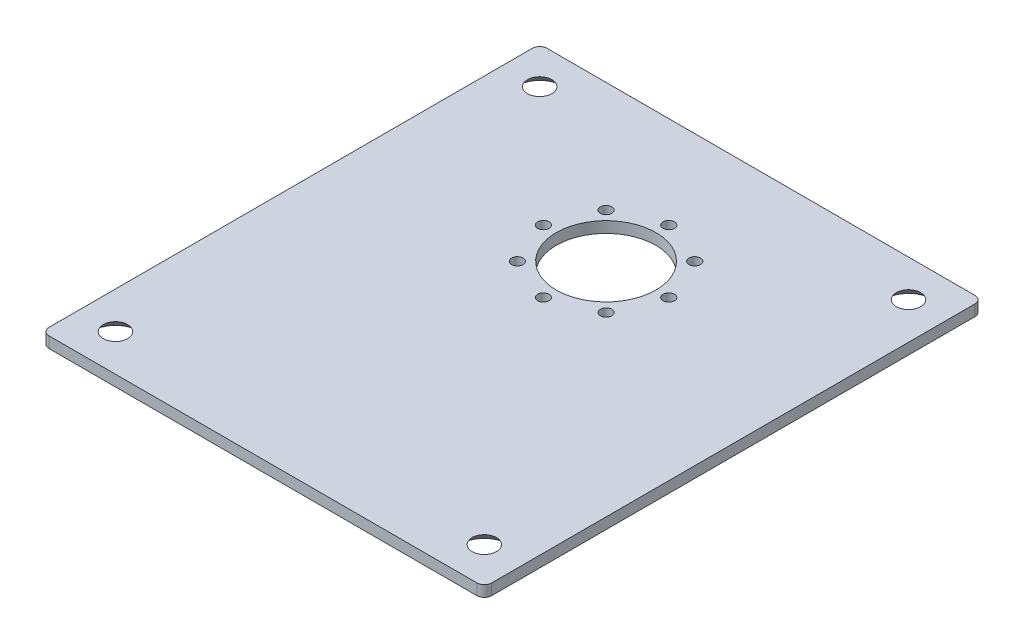
ISO-10303-21;
HEADER;
FILE_DESCRIPTION(('STEP AP214'),'2;1');
FILE_NAME('part.step','',(''),(''),'','','');
FILE_SCHEMA(('AUTOMOTIVE_DESIGN { 1 0 10303 214 1 1 1 1 }'));
ENDSEC;
DATA;
#1=APPLICATION_CONTEXT('core data for automotive mechanical design processes');
#2=APPLICATION_PROTOCOL_DEFINITION('international standard','automotive_design',2000,#1);
#3=PRODUCT_CONTEXT('',#1,'mechanical');
#4=PRODUCT('Part','Part','',(#3));
#5=PRODUCT_RELATED_PRODUCT_CATEGORY('part','',(#4));
#6=PRODUCT_DEFINITION_FORMATION('','',#4);
#7=PRODUCT_DEFINITION_CONTEXT('part definition',#1,'design');
#8=PRODUCT_DEFINITION('design','',#6,#7);
#9=PRODUCT_DEFINITION_SHAPE('','',#8);
#10=(LENGTH_UNIT() NAMED_UNIT(*) SI_UNIT(.MILLI.,.METRE.));
#11=(NAMED_UNIT(*) PLANE_ANGLE_UNIT() SI_UNIT($,.RADIAN.));
#12=(NAMED_UNIT(*) SI_UNIT($,.STERADIAN.) SOLID_ANGLE_UNIT());
#13=UNCERTAINTY_MEASURE_WITH_UNIT(LENGTH_MEASURE(1.E-05),#10,'distance_accuracy_value','');
#14=(GEOMETRIC_REPRESENTATION_CONTEXT(3) GLOBAL_UNCERTAINTY_ASSIGNED_CONTEXT((#13)) GLOBAL_UNIT_ASSIGNED_CONTEXT((#10,
#11,#12)) REPRESENTATION_CONTEXT('',''));
#15=CARTESIAN_POINT('',(0.,0.,0.));
#16=DIRECTION('',(0.,0.,1.));
#17=DIRECTION('',(1.,0.,0.));
#18=AXIS2_PLACEMENT_3D('',#15,#16,#17);
#19=CARTESIAN_POINT('',(0.,3.,0.));
#20=DIRECTION('',(0.,-1.,0.));
#21=DIRECTION('',(0.,0.,-1.));
#22=AXIS2_PLACEMENT_3D('',#19,#20,#21);
#23=PLANE('',#22);
#24=CARTESIAN_POINT('',(-50.,3.,57.5));
#25=DIRECTION('',(0.,-1.,0.));
#26=DIRECTION('',(0.,0.,-1.));
#27=AXIS2_PLACEMENT_3D('',#24,#25,#26);
#28=CIRCLE('',#27,3.3);
#29=CARTESIAN_POINT('',(-50.,3.,54.2));
#30=VERTEX_POINT('',#29);
#31=EDGE_CURVE('E403',#30,#30,#28,.T.);
#32=ORIENTED_EDGE('',*,*,#31,.T.);
#33=EDGE_LOOP('',(#32));
#34=FACE_BOUND('',#33,.T.);
#35=CARTESIAN_POINT('',(50.,3.,57.5));
#36=DIRECTION('',(0.,-1.,0.));
#37=DIRECTION('',(0.,0.,-1.));
#38=AXIS2_PLACEMENT_3D('',#35,#36,#37);
#39=CIRCLE('',#38,3.3);
#40=CARTESIAN_POINT('',(50.,3.,54.2));
#41=VERTEX_POINT('',#40);
#42=EDGE_CURVE('E408',#41,#41,#39,.T.);
#43=ORIENTED_EDGE('',*,*,#42,.T.);
#44=EDGE_LOOP('',(#43));
#45=FACE_BOUND('',#44,.T.);
#46=CARTESIAN_POINT('',(50.,3.,-57.5));
#47=DIRECTION('',(0.,-1.,0.));
#48=DIRECTION('',(0.,0.,-1.));
#49=AXIS2_PLACEMENT_3D('',#46,#47,#48);
#50=CIRCLE('',#49,3.3);
#51=CARTESIAN_POINT('',(50.,3.,-60.8));
#52=VERTEX_POINT('',#51);
#53=EDGE_CURVE('E412',#52,#52,#50,.T.);
#54=ORIENTED_EDGE('',*,*,#53,.T.);
#55=EDGE_LOOP('',(#54));
#56=FACE_BOUND('',#55,.T.);
#57=CARTESIAN_POINT('',(-50.,3.,-57.5));
#58=DIRECTION('',(0.,-1.,0.));
#59=DIRECTION('',(0.,0.,-1.));
#60=AXIS2_PLACEMENT_3D('',#57,#58,#59);
#61=CIRCLE('',#60,3.3);
#62=CARTESIAN_POINT('',(-50.,3.,-60.8));
#63=VERTEX_POINT('',#62);
#64=EDGE_CURVE('E417',#63,#63,#61,.T.);
#65=ORIENTED_EDGE('',*,*,#64,.T.);
#66=EDGE_LOOP('',(#65));
#67=FACE_BOUND('',#66,.T.);
#68=CARTESIAN_POINT('',(17.,3.,-25.5));
#69=DIRECTION('',(0.,-1.,0.));
#70=DIRECTION('',(-1.,0.,0.));
#71=AXIS2_PLACEMENT_3D('',#68,#69,#70);
#72=CIRCLE('',#71,1.55);
#73=CARTESIAN_POINT('',(15.45,3.,-25.5));
#74=VERTEX_POINT('',#73);
#75=EDGE_CURVE('E12',#74,#74,#72,.T.);
#76=ORIENTED_EDGE('',*,*,#75,.T.);
#77=EDGE_LOOP('',(#76));
#78=FACE_BOUND('',#77,.T.);
#79=CARTESIAN_POINT('',(12.0208152801713,3.,-37.5208152801713));
#80=DIRECTION('',(0.,-1.,0.));
#81=DIRECTION('',(-1.,0.,0.));
#82=AXIS2_PLACEMENT_3D('',#79,#80,#81);
#83=CIRCLE('',#82,1.55);
#84=CARTESIAN_POINT('',(10.4708152801713,3.,-37.5208152801713));
#85=VERTEX_POINT('',#84);
#86=EDGE_CURVE('E54',#85,#85,#83,.T.);
#87=ORIENTED_EDGE('',*,*,#86,.T.);
#88=EDGE_LOOP('',(#87));
#89=FACE_BOUND('',#88,.T.);
#90=CARTESIAN_POINT('',(-12.0208152801713,3.,-37.5208152801713));
#91=DIRECTION('',(0.,-1.,0.));
#92=DIRECTION('',(-1.,0.,0.));
#93=AXIS2_PLACEMENT_3D('',#90,#91,#92);
#94=CIRCLE('',#93,1.55);
#95=CARTESIAN_POINT('',(-13.5708152801713,3.,-37.5208152801713));
#96=VERTEX_POINT('',#95);
#97=EDGE_CURVE('E214',#96,#96,#94,.T.);
#98=ORIENTED_EDGE('',*,*,#97,.T.);
#99=EDGE_LOOP('',(#98));
#100=FACE_BOUND('',#99,.T.);
#101=CARTESIAN_POINT('',(0.,3.,-42.5));
#102=DIRECTION('',(0.,-1.,0.));
#103=DIRECTION('',(-1.,0.,0.));
#104=AXIS2_PLACEMENT_3D('',#101,#102,#103);
#105=CIRCLE('',#104,1.55);
#106=CARTESIAN_POINT('',(-1.55,3.,-42.5));
#107=VERTEX_POINT('',#106);
#108=EDGE_CURVE('E151',#107,#107,#105,.T.);
#109=ORIENTED_EDGE('',*,*,#108,.T.);
#110=EDGE_LOOP('',(#109));
#111=FACE_BOUND('',#110,.T.);
#112=DIRECTION('',(-1.,0.,0.));
#113=VECTOR('',#112,1.);
#114=CARTESIAN_POINT('',(60.,3.,67.5));
#115=LINE('',#114,#113);
#116=CARTESIAN_POINT('',(58.,3.,67.5));
#117=VERTEX_POINT('',#116);
#118=CARTESIAN_POINT('',(-58.,3.,67.5));
#119=VERTEX_POINT('',#118);
#120=EDGE_CURVE('E139',#117,#119,#115,.T.);
#121=ORIENTED_EDGE('',*,*,#120,.F.);
#122=CARTESIAN_POINT('',(58.,3.,65.5));
#123=DIRECTION('',(0.,1.,0.));
#124=DIRECTION('',(0.,0.,-1.));
#125=AXIS2_PLACEMENT_3D('',#122,#123,#124);
#126=CIRCLE('',#125,2.);
#127=CARTESIAN_POINT('',(60.,3.,65.5));
#128=VERTEX_POINT('',#127);
#129=EDGE_CURVE('E148',#117,#128,#126,.T.);
#130=ORIENTED_EDGE('',*,*,#129,.T.);
#131=DIRECTION('',(0.,0.,1.));
#132=VECTOR('',#131,1.);
#133=CARTESIAN_POINT('',(60.,3.,-67.5));
#134=LINE('',#133,#132);
#135=CARTESIAN_POINT('',(60.,3.,-65.5));
#136=VERTEX_POINT('',#135);
#137=EDGE_CURVE('E219',#136,#128,#134,.T.);
#138=ORIENTED_EDGE('',*,*,#137,.F.);
#139=CARTESIAN_POINT('',(58.,3.,-65.5));
#140=DIRECTION('',(0.,1.,0.));
#141=DIRECTION('',(0.,0.,-1.));
#142=AXIS2_PLACEMENT_3D('',#139,#140,#141);
#143=CIRCLE('',#142,2.);
#144=CARTESIAN_POINT('',(58.,3.,-67.5));
#145=VERTEX_POINT('',#144);
#146=EDGE_CURVE('E152',#136,#145,#143,.T.);
#147=ORIENTED_EDGE('',*,*,#146,.T.);
#148=DIRECTION('',(1.,0.,0.));
#149=VECTOR('',#148,1.);
#150=CARTESIAN_POINT('',(-60.,3.,-67.5));
#151=LINE('',#150,#149);
#152=CARTESIAN_POINT('',(-58.,3.,-67.5));
#153=VERTEX_POINT('',#152);
#154=EDGE_CURVE('E162',#153,#145,#151,.T.);
#155=ORIENTED_EDGE('',*,*,#154,.F.);
#156=CARTESIAN_POINT('',(-58.,3.,-65.5));
#157=DIRECTION('',(0.,1.,0.));
#158=DIRECTION('',(0.,0.,-1.));
#159=AXIS2_PLACEMENT_3D('',#156,#157,#158);
#160=CIRCLE('',#159,2.);
#161=CARTESIAN_POINT('',(-60.,3.,-65.5));
#162=VERTEX_POINT('',#161);
#163=EDGE_CURVE('E155',#153,#162,#160,.T.);
#164=ORIENTED_EDGE('',*,*,#163,.T.);
#165=DIRECTION('',(0.,0.,-1.));
#166=VECTOR('',#165,1.);
#167=CARTESIAN_POINT('',(-60.,3.,67.5));
#168=LINE('',#167,#166);
#169=CARTESIAN_POINT('',(-60.,3.,65.5));
#170=VERTEX_POINT('',#169);
#171=EDGE_CURVE('E204',#170,#162,#168,.T.);
#172=ORIENTED_EDGE('',*,*,#171,.F.);
#173=CARTESIAN_POINT('',(-58.,3.,65.5));
#174=DIRECTION('',(0.,1.,0.));
#175=DIRECTION('',(0.,0.,-1.));
#176=AXIS2_PLACEMENT_3D('',#173,#174,#175);
#177=CIRCLE('',#176,2.);
#178=EDGE_CURVE('E182',#170,#119,#177,.T.);
#179=ORIENTED_EDGE('',*,*,#178,.T.);
#180=EDGE_LOOP('',(#121,#130,#138,#147,#155,#164,#172,#179));
#181=FACE_BOUND('',#180,.T.);
#182=CARTESIAN_POINT('',(0.,3.,-8.5));
#183=DIRECTION('',(0.,-1.,0.));
#184=DIRECTION('',(-1.,0.,0.));
#185=AXIS2_PLACEMENT_3D('',#182,#183,#184);
#186=CIRCLE('',#185,1.55);
#187=CARTESIAN_POINT('',(-1.55,3.,-8.5));
#188=VERTEX_POINT('',#187);
#189=EDGE_CURVE('E179',#188,#188,#186,.T.);
#190=ORIENTED_EDGE('',*,*,#189,.T.);
#191=EDGE_LOOP('',(#190));
#192=FACE_BOUND('',#191,.T.);
#193=CARTESIAN_POINT('',(-12.0208152801713,3.,-13.4791847198287));
#194=DIRECTION('',(0.,-1.,0.));
#195=DIRECTION('',(-1.,0.,0.));
#196=AXIS2_PLACEMENT_3D('',#193,#194,#195);
#197=CIRCLE('',#196,1.55);
#198=CARTESIAN_POINT('',(-13.5708152801713,3.,-13.4791847198287));
#199=VERTEX_POINT('',#198);
#200=EDGE_CURVE('E176',#199,#199,#197,.T.);
#201=ORIENTED_EDGE('',*,*,#200,.T.);
#202=EDGE_LOOP('',(#201));
#203=FACE_BOUND('',#202,.T.);
#204=CARTESIAN_POINT('',(12.0208152801713,3.,-13.4791847198287));
#205=DIRECTION('',(0.,-1.,0.));
#206=DIRECTION('',(-1.,0.,0.));
#207=AXIS2_PLACEMENT_3D('',#204,#205,#206);
#208=CIRCLE('',#207,1.55);
#209=CARTESIAN_POINT('',(10.4708152801713,3.,-13.4791847198287));
#210=VERTEX_POINT('',#209);
#211=EDGE_CURVE('E138',#210,#210,#208,.T.);
#212=ORIENTED_EDGE('',*,*,#211,.T.);
#213=EDGE_LOOP('',(#212));
#214=FACE_BOUND('',#213,.T.);
#215=CARTESIAN_POINT('',(0.,3.,-25.5));
#216=DIRECTION('',(0.,-1.,0.));
#217=DIRECTION('',(-1.,0.,0.));
#218=AXIS2_PLACEMENT_3D('',#215,#216,#217);
#219=CIRCLE('',#218,13.5);
#220=CARTESIAN_POINT('',(-13.5,3.,-25.5));
#221=VERTEX_POINT('',#220);
#222=EDGE_CURVE('E135',#221,#221,#219,.T.);
#223=ORIENTED_EDGE('',*,*,#222,.T.);
#224=EDGE_LOOP('',(#223));
#225=FACE_BOUND('',#224,.T.);
#226=CARTESIAN_POINT('',(-17.,3.,-25.5));
#227=DIRECTION('',(0.,-1.,0.));
#228=DIRECTION('',(-1.,0.,0.));
#229=AXIS2_PLACEMENT_3D('',#226,#227,#228);
#230=CIRCLE('',#229,1.55);
#231=CARTESIAN_POINT('',(-18.55,3.,-25.5));
#232=VERTEX_POINT('',#231);
#233=EDGE_CURVE('E126',#232,#232,#230,.T.);
#234=ORIENTED_EDGE('',*,*,#233,.T.);
#235=EDGE_LOOP('',(#234));
#236=FACE_BOUND('',#235,.T.);
#237=ADVANCED_FACE('F44',(#34,#45,#56,#67,#78,#89,#100,#111,#181,#192,#203,#214,#225,#236),#23,.F.);
#238=CARTESIAN_POINT('',(0.,0.,0.));
#239=DIRECTION('',(0.,-1.,0.));
#240=DIRECTION('',(0.,0.,-1.));
#241=AXIS2_PLACEMENT_3D('',#238,#239,#240);
#242=PLANE('',#241);
#243=CARTESIAN_POINT('',(-50.,0.,57.5));
#244=DIRECTION('',(0.,-1.,0.));
#245=DIRECTION('',(0.,0.,-1.));
#246=AXIS2_PLACEMENT_3D('',#243,#244,#245);
#247=CIRCLE('',#246,6.3);
#248=CARTESIAN_POINT('',(-50.,0.,51.2));
#249=VERTEX_POINT('',#248);
#250=EDGE_CURVE('E312',#249,#249,#247,.T.);
#251=ORIENTED_EDGE('',*,*,#250,.F.);
#252=EDGE_LOOP('',(#251));
#253=FACE_BOUND('',#252,.T.);
#254=CARTESIAN_POINT('',(50.,0.,57.5));
#255=DIRECTION('',(0.,-1.,0.));
#256=DIRECTION('',(0.,0.,-1.));
#257=AXIS2_PLACEMENT_3D('',#254,#255,#256);
#258=CIRCLE('',#257,6.3);
#259=CARTESIAN_POINT('',(50.,0.,51.2));
#260=VERTEX_POINT('',#259);
#261=EDGE_CURVE('E316',#260,#260,#258,.T.);
#262=ORIENTED_EDGE('',*,*,#261,.F.);
#263=EDGE_LOOP('',(#262));
#264=FACE_BOUND('',#263,.T.);
#265=CARTESIAN_POINT('',(50.,0.,-57.5));
#266=DIRECTION('',(0.,-1.,0.));
#267=DIRECTION('',(0.,0.,-1.));
#268=AXIS2_PLACEMENT_3D('',#265,#266,#267);
#269=CIRCLE('',#268,6.3);
#270=CARTESIAN_POINT('',(50.,0.,-63.8));
#271=VERTEX_POINT('',#270);
#272=EDGE_CURVE('E320',#271,#271,#269,.T.);
#273=ORIENTED_EDGE('',*,*,#272,.F.);
#274=EDGE_LOOP('',(#273));
#275=FACE_BOUND('',#274,.T.);
#276=CARTESIAN_POINT('',(-50.,0.,-57.5));
#277=DIRECTION('',(0.,-1.,0.));
#278=DIRECTION('',(0.,0.,-1.));
#279=AXIS2_PLACEMENT_3D('',#276,#277,#278);
#280=CIRCLE('',#279,6.3);
#281=CARTESIAN_POINT('',(-50.,0.,-63.8));
#282=VERTEX_POINT('',#281);
#283=EDGE_CURVE('E324',#282,#282,#280,.T.);
#284=ORIENTED_EDGE('',*,*,#283,.F.);
#285=EDGE_LOOP('',(#284));
#286=FACE_BOUND('',#285,.T.);
#287=CARTESIAN_POINT('',(17.,0.,-25.5));
#288=DIRECTION('',(0.,1.,0.));
#289=DIRECTION('',(0.,0.,-1.));
#290=AXIS2_PLACEMENT_3D('',#287,#288,#289);
#291=CIRCLE('',#290,1.55);
#292=CARTESIAN_POINT('',(17.,0.,-27.05));
#293=VERTEX_POINT('',#292);
#294=EDGE_CURVE('E122',#293,#293,#291,.T.);
#295=ORIENTED_EDGE('',*,*,#294,.T.);
#296=EDGE_LOOP('',(#295));
#297=FACE_BOUND('',#296,.T.);
#298=CARTESIAN_POINT('',(12.0208152801713,0.,-37.5208152801713));
#299=DIRECTION('',(0.,1.,0.));
#300=DIRECTION('',(0.,0.,-1.));
#301=AXIS2_PLACEMENT_3D('',#298,#299,#300);
#302=CIRCLE('',#301,1.55);
#303=CARTESIAN_POINT('',(12.0208152801713,0.,-39.0708152801713));
#304=VERTEX_POINT('',#303);
#305=EDGE_CURVE('E118',#304,#304,#302,.T.);
#306=ORIENTED_EDGE('',*,*,#305,.T.);
#307=EDGE_LOOP('',(#306));
#308=FACE_BOUND('',#307,.T.);
#309=CARTESIAN_POINT('',(-12.0208152801713,0.,-37.5208152801713));
#310=DIRECTION('',(0.,1.,0.));
#311=DIRECTION('',(0.,0.,-1.));
#312=AXIS2_PLACEMENT_3D('',#309,#310,#311);
#313=CIRCLE('',#312,1.55);
#314=CARTESIAN_POINT('',(-12.0208152801713,0.,-39.0708152801713));
#315=VERTEX_POINT('',#314);
#316=EDGE_CURVE('E123',#315,#315,#313,.T.);
#317=ORIENTED_EDGE('',*,*,#316,.T.);
#318=EDGE_LOOP('',(#317));
#319=FACE_BOUND('',#318,.T.);
#320=CARTESIAN_POINT('',(0.,0.,-42.5));
#321=DIRECTION('',(0.,1.,0.));
#322=DIRECTION('',(0.,0.,-1.));
#323=AXIS2_PLACEMENT_3D('',#320,#321,#322);
#324=CIRCLE('',#323,1.55);
#325=CARTESIAN_POINT('',(0.,0.,-44.05));
#326=VERTEX_POINT('',#325);
#327=EDGE_CURVE('E129',#326,#326,#324,.T.);
#328=ORIENTED_EDGE('',*,*,#327,.T.);
#329=EDGE_LOOP('',(#328));
#330=FACE_BOUND('',#329,.T.);
#331=DIRECTION('',(0.,0.,1.));
#332=VECTOR('',#331,1.);
#333=CARTESIAN_POINT('',(60.,0.,-67.5));
#334=LINE('',#333,#332);
#335=CARTESIAN_POINT('',(60.,0.,-65.5));
#336=VERTEX_POINT('',#335);
#337=CARTESIAN_POINT('',(60.,0.,65.5));
#338=VERTEX_POINT('',#337);
#339=EDGE_CURVE('E158',#336,#338,#334,.T.);
#340=ORIENTED_EDGE('',*,*,#339,.T.);
#341=CARTESIAN_POINT('',(58.,0.,65.5));
#342=DIRECTION('',(0.,-1.,0.));
#343=DIRECTION('',(0.,0.,-1.));
#344=AXIS2_PLACEMENT_3D('',#341,#342,#343);
#345=CIRCLE('',#344,2.);
#346=CARTESIAN_POINT('',(58.,0.,67.5));
#347=VERTEX_POINT('',#346);
#348=EDGE_CURVE('E186',#338,#347,#345,.T.);
#349=ORIENTED_EDGE('',*,*,#348,.T.);
#350=DIRECTION('',(-1.,0.,0.));
#351=VECTOR('',#350,1.);
#352=CARTESIAN_POINT('',(60.,0.,67.5));
#353=LINE('',#352,#351);
#354=CARTESIAN_POINT('',(-58.,0.,67.5));
#355=VERTEX_POINT('',#354);
#356=EDGE_CURVE('E174',#347,#355,#353,.T.);
#357=ORIENTED_EDGE('',*,*,#356,.T.);
#358=CARTESIAN_POINT('',(-58.,0.,65.5));
#359=DIRECTION('',(0.,-1.,0.));
#360=DIRECTION('',(0.,0.,-1.));
#361=AXIS2_PLACEMENT_3D('',#358,#359,#360);
#362=CIRCLE('',#361,2.);
#363=CARTESIAN_POINT('',(-60.,0.,65.5));
#364=VERTEX_POINT('',#363);
#365=EDGE_CURVE('E171',#355,#364,#362,.T.);
#366=ORIENTED_EDGE('',*,*,#365,.T.);
#367=DIRECTION('',(0.,0.,-1.));
#368=VECTOR('',#367,1.);
#369=CARTESIAN_POINT('',(-60.,0.,67.5));
#370=LINE('',#369,#368);
#371=CARTESIAN_POINT('',(-60.,0.,-65.5));
#372=VERTEX_POINT('',#371);
#373=EDGE_CURVE('E175',#364,#372,#370,.T.);
#374=ORIENTED_EDGE('',*,*,#373,.T.);
#375=CARTESIAN_POINT('',(-58.,0.,-65.5));
#376=DIRECTION('',(0.,-1.,0.));
#377=DIRECTION('',(0.,0.,-1.));
#378=AXIS2_PLACEMENT_3D('',#375,#376,#377);
#379=CIRCLE('',#378,2.);
#380=CARTESIAN_POINT('',(-58.,0.,-67.5));
#381=VERTEX_POINT('',#380);
#382=EDGE_CURVE('E146',#372,#381,#379,.T.);
#383=ORIENTED_EDGE('',*,*,#382,.T.);
#384=DIRECTION('',(1.,0.,0.));
#385=VECTOR('',#384,1.);
#386=CARTESIAN_POINT('',(-60.,0.,-67.5));
#387=LINE('',#386,#385);
#388=CARTESIAN_POINT('',(58.,0.,-67.5));
#389=VERTEX_POINT('',#388);
#390=EDGE_CURVE('E143',#381,#389,#387,.T.);
#391=ORIENTED_EDGE('',*,*,#390,.T.);
#392=CARTESIAN_POINT('',(58.,0.,-65.5));
#393=DIRECTION('',(0.,-1.,0.));
#394=DIRECTION('',(0.,0.,-1.));
#395=AXIS2_PLACEMENT_3D('',#392,#393,#394);
#396=CIRCLE('',#395,2.);
#397=EDGE_CURVE('E147',#389,#336,#396,.T.);
#398=ORIENTED_EDGE('',*,*,#397,.T.);
#399=EDGE_LOOP('',(#340,#349,#357,#366,#374,#383,#391,#398));
#400=FACE_BOUND('',#399,.T.);
#401=CARTESIAN_POINT('',(0.,0.,-8.5));
#402=DIRECTION('',(0.,1.,0.));
#403=DIRECTION('',(0.,0.,-1.));
#404=AXIS2_PLACEMENT_3D('',#401,#402,#403);
#405=CIRCLE('',#404,1.55);
#406=CARTESIAN_POINT('',(0.,0.,-10.05));
#407=VERTEX_POINT('',#406);
#408=EDGE_CURVE('E167',#407,#407,#405,.T.);
#409=ORIENTED_EDGE('',*,*,#408,.T.);
#410=EDGE_LOOP('',(#409));
#411=FACE_BOUND('',#410,.T.);
#412=CARTESIAN_POINT('',(-12.0208152801713,0.,-13.4791847198287));
#413=DIRECTION('',(0.,1.,0.));
#414=DIRECTION('',(0.,0.,-1.));
#415=AXIS2_PLACEMENT_3D('',#412,#413,#414);
#416=CIRCLE('',#415,1.55);
#417=CARTESIAN_POINT('',(-12.0208152801713,0.,-15.0291847198287));
#418=VERTEX_POINT('',#417);
#419=EDGE_CURVE('E163',#418,#418,#416,.T.);
#420=ORIENTED_EDGE('',*,*,#419,.T.);
#421=EDGE_LOOP('',(#420));
#422=FACE_BOUND('',#421,.T.);
#423=CARTESIAN_POINT('',(12.0208152801713,0.,-13.4791847198287));
#424=DIRECTION('',(0.,1.,0.));
#425=DIRECTION('',(0.,0.,-1.));
#426=AXIS2_PLACEMENT_3D('',#423,#424,#425);
#427=CIRCLE('',#426,1.55);
#428=CARTESIAN_POINT('',(12.0208152801713,0.,-15.0291847198287));
#429=VERTEX_POINT('',#428);
#430=EDGE_CURVE('E168',#429,#429,#427,.T.);
#431=ORIENTED_EDGE('',*,*,#430,.T.);
#432=EDGE_LOOP('',(#431));
#433=FACE_BOUND('',#432,.T.);
#434=CARTESIAN_POINT('',(0.,0.,-25.5));
#435=DIRECTION('',(0.,1.,0.));
#436=DIRECTION('',(0.,0.,-1.));
#437=AXIS2_PLACEMENT_3D('',#434,#435,#436);
#438=CIRCLE('',#437,13.5);
#439=CARTESIAN_POINT('',(0.,0.,-39.));
#440=VERTEX_POINT('',#439);
#441=EDGE_CURVE('E193',#440,#440,#438,.T.);
#442=ORIENTED_EDGE('',*,*,#441,.T.);
#443=EDGE_LOOP('',(#442));
#444=FACE_BOUND('',#443,.T.);
#445=CARTESIAN_POINT('',(-17.,0.,-25.5));
#446=DIRECTION('',(0.,1.,0.));
#447=DIRECTION('',(0.,0.,-1.));
#448=AXIS2_PLACEMENT_3D('',#445,#446,#447);
#449=CIRCLE('',#448,1.55);
#450=CARTESIAN_POINT('',(-17.,0.,-27.05));
#451=VERTEX_POINT('',#450);
#452=EDGE_CURVE('E207',#451,#451,#449,.T.);
#453=ORIENTED_EDGE('',*,*,#452,.T.);
#454=EDGE_LOOP('',(#453));
#455=FACE_BOUND('',#454,.T.);
#456=ADVANCED_FACE('F46',(#253,#264,#275,#286,#297,#308,#319,#330,#400,#411,#422,#433,#444,
#455),#242,.T.);
#457=CARTESIAN_POINT('',(-60.,3.,67.5));
#458=DIRECTION('',(-1.,0.,0.));
#459=DIRECTION('',(0.,0.,1.));
#460=AXIS2_PLACEMENT_3D('',#457,#458,#459);
#461=PLANE('',#460);
#462=ORIENTED_EDGE('',*,*,#171,.T.);
#463=DIRECTION('',(0.,-1.,0.));
#464=VECTOR('',#463,1.);
#465=CARTESIAN_POINT('',(-60.,3.,-65.5));
#466=LINE('',#465,#464);
#467=EDGE_CURVE('E48',#162,#372,#466,.T.);
#468=ORIENTED_EDGE('',*,*,#467,.T.);
#469=ORIENTED_EDGE('',*,*,#373,.F.);
#470=DIRECTION('',(0.,1.,0.));
#471=VECTOR('',#470,1.);
#472=CARTESIAN_POINT('',(-60.,3.,65.5));
#473=LINE('',#472,#471);
#474=EDGE_CURVE('E159',#364,#170,#473,.T.);
#475=ORIENTED_EDGE('',*,*,#474,.T.);
#476=EDGE_LOOP('',(#462,#468,#469,#475));
#477=FACE_BOUND('',#476,.T.);
#478=ADVANCED_FACE('F299',(#477),#461,.T.);
#479=CARTESIAN_POINT('',(-60.,3.,-67.5));
#480=DIRECTION('',(0.,0.,-1.));
#481=DIRECTION('',(0.,-1.,0.));
#482=AXIS2_PLACEMENT_3D('',#479,#480,#481);
#483=PLANE('',#482);
#484=ORIENTED_EDGE('',*,*,#154,.T.);
#485=DIRECTION('',(0.,-1.,0.));
#486=VECTOR('',#485,1.);
#487=CARTESIAN_POINT('',(58.,3.,-67.5));
#488=LINE('',#487,#486);
#489=EDGE_CURVE('E194',#145,#389,#488,.T.);
#490=ORIENTED_EDGE('',*,*,#489,.T.);
#491=ORIENTED_EDGE('',*,*,#390,.F.);
#492=DIRECTION('',(0.,1.,0.));
#493=VECTOR('',#492,1.);
#494=CARTESIAN_POINT('',(-58.,3.,-67.5));
#495=LINE('',#494,#493);
#496=EDGE_CURVE('E197',#381,#153,#495,.T.);
#497=ORIENTED_EDGE('',*,*,#496,.T.);
#498=EDGE_LOOP('',(#484,#490,#491,#497));
#499=FACE_BOUND('',#498,.T.);
#500=ADVANCED_FACE('F273',(#499),#483,.T.);
#501=CARTESIAN_POINT('',(60.,3.,-67.5));
#502=DIRECTION('',(1.,0.,0.));
#503=DIRECTION('',(0.,1.,0.));
#504=AXIS2_PLACEMENT_3D('',#501,#502,#503);
#505=PLANE('',#504);
#506=ORIENTED_EDGE('',*,*,#137,.T.);
#507=DIRECTION('',(0.,-1.,0.));
#508=VECTOR('',#507,1.);
#509=CARTESIAN_POINT('',(60.,3.,65.5));
#510=LINE('',#509,#508);
#511=EDGE_CURVE('E216',#128,#338,#510,.T.);
#512=ORIENTED_EDGE('',*,*,#511,.T.);
#513=ORIENTED_EDGE('',*,*,#339,.F.);
#514=DIRECTION('',(0.,1.,0.));
#515=VECTOR('',#514,1.);
#516=CARTESIAN_POINT('',(60.,3.,-65.5));
#517=LINE('',#516,#515);
#518=EDGE_CURVE('E220',#336,#136,#517,.T.);
#519=ORIENTED_EDGE('',*,*,#518,.T.);
#520=EDGE_LOOP('',(#506,#512,#513,#519));
#521=FACE_BOUND('',#520,.T.);
#522=ADVANCED_FACE('F240',(#521),#505,.T.);
#523=CARTESIAN_POINT('',(60.,3.,67.5));
#524=DIRECTION('',(0.,0.,1.));
#525=DIRECTION('',(1.,0.,0.));
#526=AXIS2_PLACEMENT_3D('',#523,#524,#525);
#527=PLANE('',#526);
#528=ORIENTED_EDGE('',*,*,#356,.F.);
#529=DIRECTION('',(0.,1.,0.));
#530=VECTOR('',#529,1.);
#531=CARTESIAN_POINT('',(58.,3.,67.5));
#532=LINE('',#531,#530);
#533=EDGE_CURVE('E141',#347,#117,#532,.T.);
#534=ORIENTED_EDGE('',*,*,#533,.T.);
#535=ORIENTED_EDGE('',*,*,#120,.T.);
#536=DIRECTION('',(0.,-1.,0.));
#537=VECTOR('',#536,1.);
#538=CARTESIAN_POINT('',(-58.,3.,67.5));
#539=LINE('',#538,#537);
#540=EDGE_CURVE('E133',#119,#355,#539,.T.);
#541=ORIENTED_EDGE('',*,*,#540,.T.);
#542=EDGE_LOOP('',(#528,#534,#535,#541));
#543=FACE_BOUND('',#542,.T.);
#544=ADVANCED_FACE('F349',(#543),#527,.T.);
#545=CARTESIAN_POINT('',(-58.,3.,65.5));
#546=DIRECTION('',(0.,-1.,0.));
#547=DIRECTION('',(0.,0.,-1.));
#548=AXIS2_PLACEMENT_3D('',#545,#546,#547);
#549=CYLINDRICAL_SURFACE('',#548,2.);
#550=ORIENTED_EDGE('',*,*,#178,.F.);
#551=ORIENTED_EDGE('',*,*,#474,.F.);
#552=ORIENTED_EDGE('',*,*,#365,.F.);
#553=ORIENTED_EDGE('',*,*,#540,.F.);
#554=EDGE_LOOP('',(#550,#551,#552,#553));
#555=FACE_BOUND('',#554,.T.);
#556=ADVANCED_FACE('F348',(#555),#549,.T.);
#557=CARTESIAN_POINT('',(-58.,3.,-65.5));
#558=DIRECTION('',(0.,-1.,0.));
#559=DIRECTION('',(0.,0.,-1.));
#560=AXIS2_PLACEMENT_3D('',#557,#558,#559);
#561=CYLINDRICAL_SURFACE('',#560,2.);
#562=ORIENTED_EDGE('',*,*,#163,.F.);
#563=ORIENTED_EDGE('',*,*,#496,.F.);
#564=ORIENTED_EDGE('',*,*,#382,.F.);
#565=ORIENTED_EDGE('',*,*,#467,.F.);
#566=EDGE_LOOP('',(#562,#563,#564,#565));
#567=FACE_BOUND('',#566,.T.);
#568=ADVANCED_FACE('F268',(#567),#561,.T.);
#569=CARTESIAN_POINT('',(58.,3.,-65.5));
#570=DIRECTION('',(0.,-1.,0.));
#571=DIRECTION('',(0.,0.,-1.));
#572=AXIS2_PLACEMENT_3D('',#569,#570,#571);
#573=CYLINDRICAL_SURFACE('',#572,2.);
#574=ORIENTED_EDGE('',*,*,#146,.F.);
#575=ORIENTED_EDGE('',*,*,#518,.F.);
#576=ORIENTED_EDGE('',*,*,#397,.F.);
#577=ORIENTED_EDGE('',*,*,#489,.F.);
#578=EDGE_LOOP('',(#574,#575,#576,#577));
#579=FACE_BOUND('',#578,.T.);
#580=ADVANCED_FACE('F256',(#579),#573,.T.);
#581=CARTESIAN_POINT('',(58.,3.,65.5));
#582=DIRECTION('',(0.,-1.,0.));
#583=DIRECTION('',(0.,0.,-1.));
#584=AXIS2_PLACEMENT_3D('',#581,#582,#583);
#585=CYLINDRICAL_SURFACE('',#584,2.);
#586=ORIENTED_EDGE('',*,*,#129,.F.);
#587=ORIENTED_EDGE('',*,*,#533,.F.);
#588=ORIENTED_EDGE('',*,*,#348,.F.);
#589=ORIENTED_EDGE('',*,*,#511,.F.);
#590=EDGE_LOOP('',(#586,#587,#588,#589));
#591=FACE_BOUND('',#590,.T.);
#592=ADVANCED_FACE('F251',(#591),#585,.T.);
#593=CARTESIAN_POINT('',(0.,-107.,-8.5));
#594=DIRECTION('',(0.,1.,0.));
#595=DIRECTION('',(0.,0.,1.));
#596=AXIS2_PLACEMENT_3D('',#593,#594,#595);
#597=CYLINDRICAL_SURFACE('',#596,1.55);
#598=ORIENTED_EDGE('',*,*,#408,.F.);
#599=EDGE_LOOP('',(#598));
#600=FACE_BOUND('',#599,.T.);
#601=ORIENTED_EDGE('',*,*,#189,.F.);
#602=EDGE_LOOP('',(#601));
#603=FACE_BOUND('',#602,.T.);
#604=ADVANCED_FACE('F336',(#600,#603),#597,.F.);
#605=CARTESIAN_POINT('',(0.,-107.,-42.5));
#606=DIRECTION('',(0.,1.,0.));
#607=DIRECTION('',(0.,0.,1.));
#608=AXIS2_PLACEMENT_3D('',#605,#606,#607);
#609=CYLINDRICAL_SURFACE('',#608,1.55);
#610=ORIENTED_EDGE('',*,*,#327,.F.);
#611=EDGE_LOOP('',(#610));
#612=FACE_BOUND('',#611,.T.);
#613=ORIENTED_EDGE('',*,*,#108,.F.);
#614=EDGE_LOOP('',(#613));
#615=FACE_BOUND('',#614,.T.);
#616=ADVANCED_FACE('F295',(#612,#615),#609,.F.);
#617=CARTESIAN_POINT('',(-12.0208152801713,-107.,-13.4791847198287));
#618=DIRECTION('',(0.,1.,0.));
#619=DIRECTION('',(0.,0.,1.));
#620=AXIS2_PLACEMENT_3D('',#617,#618,#619);
#621=CYLINDRICAL_SURFACE('',#620,1.55);
#622=ORIENTED_EDGE('',*,*,#419,.F.);
#623=EDGE_LOOP('',(#622));
#624=FACE_BOUND('',#623,.T.);
#625=ORIENTED_EDGE('',*,*,#200,.F.);
#626=EDGE_LOOP('',(#625));
#627=FACE_BOUND('',#626,.T.);
#628=ADVANCED_FACE('F331',(#624,#627),#621,.F.);
#629=CARTESIAN_POINT('',(-12.0208152801713,-107.,-37.5208152801713));
#630=DIRECTION('',(0.,1.,0.));
#631=DIRECTION('',(0.,0.,1.));
#632=AXIS2_PLACEMENT_3D('',#629,#630,#631);
#633=CYLINDRICAL_SURFACE('',#632,1.55);
#634=ORIENTED_EDGE('',*,*,#316,.F.);
#635=EDGE_LOOP('',(#634));
#636=FACE_BOUND('',#635,.T.);
#637=ORIENTED_EDGE('',*,*,#97,.F.);
#638=EDGE_LOOP('',(#637));
#639=FACE_BOUND('',#638,.T.);
#640=ADVANCED_FACE('F327',(#636,#639),#633,.F.);
#641=CARTESIAN_POINT('',(12.0208152801713,-107.,-13.4791847198287));
#642=DIRECTION('',(0.,1.,0.));
#643=DIRECTION('',(0.,0.,1.));
#644=AXIS2_PLACEMENT_3D('',#641,#642,#643);
#645=CYLINDRICAL_SURFACE('',#644,1.55);
#646=ORIENTED_EDGE('',*,*,#430,.F.);
#647=EDGE_LOOP('',(#646));
#648=FACE_BOUND('',#647,.T.);
#649=ORIENTED_EDGE('',*,*,#211,.F.);
#650=EDGE_LOOP('',(#649));
#651=FACE_BOUND('',#650,.T.);
#652=ADVANCED_FACE('F330',(#648,#651),#645,.F.);
#653=CARTESIAN_POINT('',(12.0208152801713,-107.,-37.5208152801713));
#654=DIRECTION('',(0.,1.,0.));
#655=DIRECTION('',(0.,0.,1.));
#656=AXIS2_PLACEMENT_3D('',#653,#654,#655);
#657=CYLINDRICAL_SURFACE('',#656,1.55);
#658=ORIENTED_EDGE('',*,*,#305,.F.);
#659=EDGE_LOOP('',(#658));
#660=FACE_BOUND('',#659,.T.);
#661=ORIENTED_EDGE('',*,*,#86,.F.);
#662=EDGE_LOOP('',(#661));
#663=FACE_BOUND('',#662,.T.);
#664=ADVANCED_FACE('F119',(#660,#663),#657,.F.);
#665=CARTESIAN_POINT('',(0.,-107.,-25.5));
#666=DIRECTION('',(0.,1.,0.));
#667=DIRECTION('',(0.,0.,1.));
#668=AXIS2_PLACEMENT_3D('',#665,#666,#667);
#669=CYLINDRICAL_SURFACE('',#668,13.5);
#670=ORIENTED_EDGE('',*,*,#441,.F.);
#671=EDGE_LOOP('',(#670));
#672=FACE_BOUND('',#671,.T.);
#673=ORIENTED_EDGE('',*,*,#222,.F.);
#674=EDGE_LOOP('',(#673));
#675=FACE_BOUND('',#674,.T.);
#676=ADVANCED_FACE('F355',(#672,#675),#669,.F.);
#677=CARTESIAN_POINT('',(17.,-107.,-25.5));
#678=DIRECTION('',(0.,1.,0.));
#679=DIRECTION('',(0.,0.,1.));
#680=AXIS2_PLACEMENT_3D('',#677,#678,#679);
#681=CYLINDRICAL_SURFACE('',#680,1.55);
#682=ORIENTED_EDGE('',*,*,#294,.F.);
#683=EDGE_LOOP('',(#682));
#684=FACE_BOUND('',#683,.T.);
#685=ORIENTED_EDGE('',*,*,#75,.F.);
#686=EDGE_LOOP('',(#685));
#687=FACE_BOUND('',#686,.T.);
#688=ADVANCED_FACE('F358',(#684,#687),#681,.F.);
#689=CARTESIAN_POINT('',(-17.,-107.,-25.5));
#690=DIRECTION('',(0.,1.,0.));
#691=DIRECTION('',(0.,0.,1.));
#692=AXIS2_PLACEMENT_3D('',#689,#690,#691);
#693=CYLINDRICAL_SURFACE('',#692,1.55);
#694=ORIENTED_EDGE('',*,*,#452,.F.);
#695=EDGE_LOOP('',(#694));
#696=FACE_BOUND('',#695,.T.);
#697=ORIENTED_EDGE('',*,*,#233,.F.);
#698=EDGE_LOOP('',(#697));
#699=FACE_BOUND('',#698,.T.);
#700=ADVANCED_FACE('F362',(#696,#699),#693,.F.);
#701=CARTESIAN_POINT('',(-50.,0.,-57.5));
#702=DIRECTION('',(0.,-1.,0.));
#703=DIRECTION('',(0.,0.,-1.));
#704=AXIS2_PLACEMENT_3D('',#701,#702,#703);
#705=CONICAL_SURFACE('',#704,6.3,0.78539816339745);
#706=ORIENTED_EDGE('',*,*,#64,.F.);
#707=EDGE_LOOP('',(#706));
#708=FACE_BOUND('',#707,.T.);
#709=ORIENTED_EDGE('',*,*,#283,.T.);
#710=EDGE_LOOP('',(#709));
#711=FACE_BOUND('',#710,.T.);
#712=ADVANCED_FACE('F365',(#708,#711),#705,.F.);
#713=CARTESIAN_POINT('',(50.,0.,-57.5));
#714=DIRECTION('',(0.,-1.,0.));
#715=DIRECTION('',(0.,0.,-1.));
#716=AXIS2_PLACEMENT_3D('',#713,#714,#715);
#717=CONICAL_SURFACE('',#716,6.3,0.78539816339745);
#718=ORIENTED_EDGE('',*,*,#53,.F.);
#719=EDGE_LOOP('',(#718));
#720=FACE_BOUND('',#719,.T.);
#721=ORIENTED_EDGE('',*,*,#272,.T.);
#722=EDGE_LOOP('',(#721));
#723=FACE_BOUND('',#722,.T.);
#724=ADVANCED_FACE('F386',(#720,#723),#717,.F.);
#725=CARTESIAN_POINT('',(50.,0.,57.5));
#726=DIRECTION('',(0.,-1.,0.));
#727=DIRECTION('',(0.,0.,-1.));
#728=AXIS2_PLACEMENT_3D('',#725,#726,#727);
#729=CONICAL_SURFACE('',#728,6.3,0.78539816339745);
#730=ORIENTED_EDGE('',*,*,#42,.F.);
#731=EDGE_LOOP('',(#730));
#732=FACE_BOUND('',#731,.T.);
#733=ORIENTED_EDGE('',*,*,#261,.T.);
#734=EDGE_LOOP('',(#733));
#735=FACE_BOUND('',#734,.T.);
#736=ADVANCED_FACE('F390',(#732,#735),#729,.F.);
#737=CARTESIAN_POINT('',(-50.,0.,57.5));
#738=DIRECTION('',(0.,-1.,0.));
#739=DIRECTION('',(0.,0.,-1.));
#740=AXIS2_PLACEMENT_3D('',#737,#738,#739);
#741=CONICAL_SURFACE('',#740,6.3,0.78539816339745);
#742=ORIENTED_EDGE('',*,*,#31,.F.);
#743=EDGE_LOOP('',(#742));
#744=FACE_BOUND('',#743,.T.);
#745=ORIENTED_EDGE('',*,*,#250,.T.);
#746=EDGE_LOOP('',(#745));
#747=FACE_BOUND('',#746,.T.);
#748=ADVANCED_FACE('F394',(#744,#747),#741,.F.);
#749=CLOSED_SHELL('',(#237,#456,#478,#500,#522,#544,#556,#568,#580,#592,#604,#616,#628,#640,
#652,#664,#676,#688,#700,#712,#724,#736,#748));
#750=MANIFOLD_SOLID_BREP('B2',#749);
#751=ADVANCED_BREP_SHAPE_REPRESENTATION('',(#18,#750),#14);
#752=SHAPE_DEFINITION_REPRESENTATION(#9,#751);
ENDSEC;
END-ISO-10303-21;
